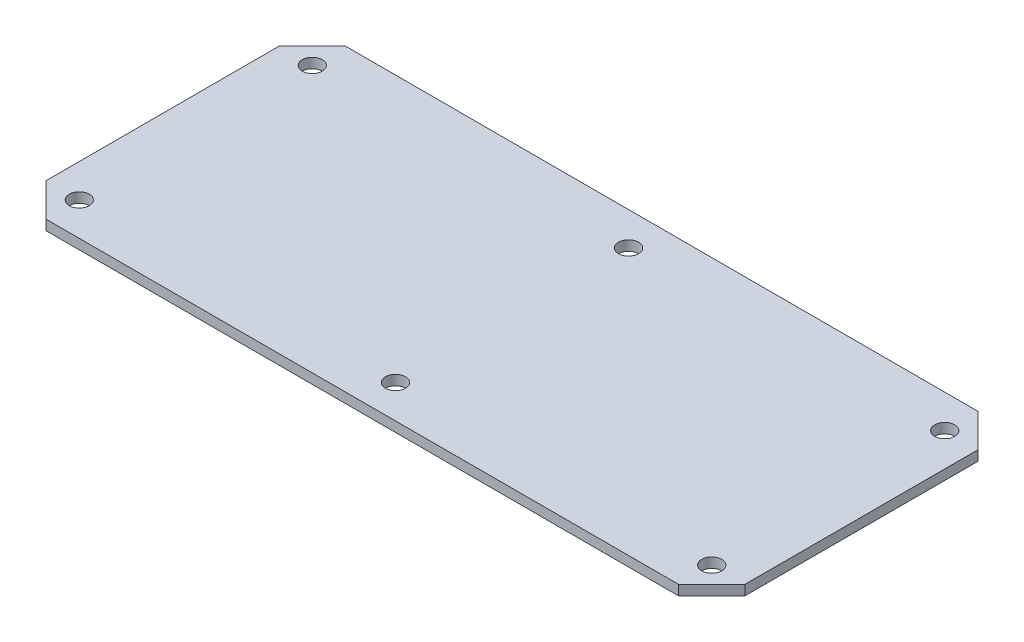
ISO-10303-21;
HEADER;
FILE_DESCRIPTION(('STEP AP214'),'2;1');
FILE_NAME('part.step','',(''),(''),'','','');
FILE_SCHEMA(('AUTOMOTIVE_DESIGN { 1 0 10303 214 1 1 1 1 }'));
ENDSEC;
DATA;
#1=APPLICATION_CONTEXT('core data for automotive mechanical design processes');
#2=APPLICATION_PROTOCOL_DEFINITION('international standard','automotive_design',2000,#1);
#3=PRODUCT_CONTEXT('',#1,'mechanical');
#4=PRODUCT('Part','Part','',(#3));
#5=PRODUCT_RELATED_PRODUCT_CATEGORY('part','',(#4));
#6=PRODUCT_DEFINITION_FORMATION('','',#4);
#7=PRODUCT_DEFINITION_CONTEXT('part definition',#1,'design');
#8=PRODUCT_DEFINITION('design','',#6,#7);
#9=PRODUCT_DEFINITION_SHAPE('','',#8);
#10=(LENGTH_UNIT() NAMED_UNIT(*) SI_UNIT(.MILLI.,.METRE.));
#11=(NAMED_UNIT(*) PLANE_ANGLE_UNIT() SI_UNIT($,.RADIAN.));
#12=(NAMED_UNIT(*) SI_UNIT($,.STERADIAN.) SOLID_ANGLE_UNIT());
#13=UNCERTAINTY_MEASURE_WITH_UNIT(LENGTH_MEASURE(1.E-05),#10,'distance_accuracy_value','');
#14=(GEOMETRIC_REPRESENTATION_CONTEXT(3) GLOBAL_UNCERTAINTY_ASSIGNED_CONTEXT((#13)) GLOBAL_UNIT_ASSIGNED_CONTEXT((#10,
#11,#12)) REPRESENTATION_CONTEXT('',''));
#15=CARTESIAN_POINT('',(0.,0.,0.));
#16=DIRECTION('',(0.,0.,1.));
#17=DIRECTION('',(1.,0.,0.));
#18=AXIS2_PLACEMENT_3D('',#15,#16,#17);
#19=CARTESIAN_POINT('',(210.,3.,-90.));
#20=DIRECTION('',(-1.,0.,0.));
#21=DIRECTION('',(0.,0.,1.));
#22=AXIS2_PLACEMENT_3D('',#19,#20,#21);
#23=PLANE('',#22);
#24=DIRECTION('',(0.,0.,-1.));
#25=VECTOR('',#24,1.);
#26=CARTESIAN_POINT('',(210.,3.,-90.));
#27=LINE('',#26,#25);
#28=CARTESIAN_POINT('',(210.,3.,-10.0000000000001));
#29=VERTEX_POINT('',#28);
#30=CARTESIAN_POINT('',(210.,3.,-79.9999999999999));
#31=VERTEX_POINT('',#30);
#32=EDGE_CURVE('E116',#29,#31,#27,.T.);
#33=ORIENTED_EDGE('',*,*,#32,.F.);
#34=DIRECTION('',(0.,-1.,0.));
#35=VECTOR('',#34,1.);
#36=CARTESIAN_POINT('',(210.,3.,-10.));
#37=LINE('',#36,#35);
#38=CARTESIAN_POINT('',(210.,0.,-10.0000000000001));
#39=VERTEX_POINT('',#38);
#40=EDGE_CURVE('E101',#29,#39,#37,.T.);
#41=ORIENTED_EDGE('',*,*,#40,.T.);
#42=DIRECTION('',(0.,0.,-1.));
#43=VECTOR('',#42,1.);
#44=CARTESIAN_POINT('',(210.,0.,-90.));
#45=LINE('',#44,#43);
#46=CARTESIAN_POINT('',(210.,0.,-79.9999999999999));
#47=VERTEX_POINT('',#46);
#48=EDGE_CURVE('E113',#39,#47,#45,.T.);
#49=ORIENTED_EDGE('',*,*,#48,.T.);
#50=DIRECTION('',(0.,1.,0.));
#51=VECTOR('',#50,1.);
#52=CARTESIAN_POINT('',(210.,3.,-79.9999999999999));
#53=LINE('',#52,#51);
#54=EDGE_CURVE('E118',#47,#31,#53,.T.);
#55=ORIENTED_EDGE('',*,*,#54,.T.);
#56=EDGE_LOOP('',(#33,#41,#49,#55));
#57=FACE_BOUND('',#56,.T.);
#58=ADVANCED_FACE('F32',(#57),#23,.F.);
#59=CARTESIAN_POINT('',(210.,3.,-90.));
#60=DIRECTION('',(0.,0.,1.));
#61=DIRECTION('',(1.,0.,0.));
#62=AXIS2_PLACEMENT_3D('',#59,#60,#61);
#63=PLANE('',#62);
#64=DIRECTION('',(-1.,0.,0.));
#65=VECTOR('',#64,1.);
#66=CARTESIAN_POINT('',(210.,3.,-90.));
#67=LINE('',#66,#65);
#68=CARTESIAN_POINT('',(200.,3.,-90.));
#69=VERTEX_POINT('',#68);
#70=CARTESIAN_POINT('',(10.0000000000001,3.,-90.));
#71=VERTEX_POINT('',#70);
#72=EDGE_CURVE('E171',#69,#71,#67,.T.);
#73=ORIENTED_EDGE('',*,*,#72,.F.);
#74=DIRECTION('',(0.,-1.,0.));
#75=VECTOR('',#74,1.);
#76=CARTESIAN_POINT('',(200.,3.,-90.));
#77=LINE('',#76,#75);
#78=CARTESIAN_POINT('',(200.,0.,-90.));
#79=VERTEX_POINT('',#78);
#80=EDGE_CURVE('E155',#69,#79,#77,.T.);
#81=ORIENTED_EDGE('',*,*,#80,.T.);
#82=DIRECTION('',(-1.,0.,0.));
#83=VECTOR('',#82,1.);
#84=CARTESIAN_POINT('',(210.,0.,-90.));
#85=LINE('',#84,#83);
#86=CARTESIAN_POINT('',(10.0000000000001,0.,-90.));
#87=VERTEX_POINT('',#86);
#88=EDGE_CURVE('E122',#79,#87,#85,.T.);
#89=ORIENTED_EDGE('',*,*,#88,.T.);
#90=DIRECTION('',(0.,1.,0.));
#91=VECTOR('',#90,1.);
#92=CARTESIAN_POINT('',(10.0000000000001,3.,-90.));
#93=LINE('',#92,#91);
#94=EDGE_CURVE('E153',#87,#71,#93,.T.);
#95=ORIENTED_EDGE('',*,*,#94,.T.);
#96=EDGE_LOOP('',(#73,#81,#89,#95));
#97=FACE_BOUND('',#96,.T.);
#98=ADVANCED_FACE('F236',(#97),#63,.F.);
#99=CARTESIAN_POINT('',(0.,3.,-90.));
#100=DIRECTION('',(1.,0.,0.));
#101=DIRECTION('',(0.,0.,-1.));
#102=AXIS2_PLACEMENT_3D('',#99,#100,#101);
#103=PLANE('',#102);
#104=DIRECTION('',(0.,0.,1.));
#105=VECTOR('',#104,1.);
#106=CARTESIAN_POINT('',(0.,0.,-90.));
#107=LINE('',#106,#105);
#108=CARTESIAN_POINT('',(0.,0.,-80.));
#109=VERTEX_POINT('',#108);
#110=CARTESIAN_POINT('',(0.,0.,-10.0000000000001));
#111=VERTEX_POINT('',#110);
#112=EDGE_CURVE('E126',#109,#111,#107,.T.);
#113=ORIENTED_EDGE('',*,*,#112,.T.);
#114=DIRECTION('',(0.,1.,0.));
#115=VECTOR('',#114,1.);
#116=CARTESIAN_POINT('',(0.,3.,-10.0000000000001));
#117=LINE('',#116,#115);
#118=CARTESIAN_POINT('',(0.,3.,-10.0000000000001));
#119=VERTEX_POINT('',#118);
#120=EDGE_CURVE('E11',#111,#119,#117,.T.);
#121=ORIENTED_EDGE('',*,*,#120,.T.);
#122=DIRECTION('',(0.,0.,1.));
#123=VECTOR('',#122,1.);
#124=CARTESIAN_POINT('',(0.,3.,-90.));
#125=LINE('',#124,#123);
#126=CARTESIAN_POINT('',(0.,3.,-80.));
#127=VERTEX_POINT('',#126);
#128=EDGE_CURVE('E161',#127,#119,#125,.T.);
#129=ORIENTED_EDGE('',*,*,#128,.F.);
#130=DIRECTION('',(0.,-1.,0.));
#131=VECTOR('',#130,1.);
#132=CARTESIAN_POINT('',(0.,3.,-80.));
#133=LINE('',#132,#131);
#134=EDGE_CURVE('E40',#127,#109,#133,.T.);
#135=ORIENTED_EDGE('',*,*,#134,.T.);
#136=EDGE_LOOP('',(#113,#121,#129,#135));
#137=FACE_BOUND('',#136,.T.);
#138=ADVANCED_FACE('F160',(#137),#103,.F.);
#139=CARTESIAN_POINT('',(210.,3.,0.));
#140=DIRECTION('',(0.,0.,-1.));
#141=DIRECTION('',(-1.,0.,0.));
#142=AXIS2_PLACEMENT_3D('',#139,#140,#141);
#143=PLANE('',#142);
#144=DIRECTION('',(1.,0.,0.));
#145=VECTOR('',#144,1.);
#146=CARTESIAN_POINT('',(210.,0.,0.));
#147=LINE('',#146,#145);
#148=CARTESIAN_POINT('',(10.,0.,0.));
#149=VERTEX_POINT('',#148);
#150=CARTESIAN_POINT('',(200.,0.,0.));
#151=VERTEX_POINT('',#150);
#152=EDGE_CURVE('E136',#149,#151,#147,.T.);
#153=ORIENTED_EDGE('',*,*,#152,.T.);
#154=DIRECTION('',(0.,1.,0.));
#155=VECTOR('',#154,1.);
#156=CARTESIAN_POINT('',(200.,3.,0.));
#157=LINE('',#156,#155);
#158=CARTESIAN_POINT('',(200.,3.,0.));
#159=VERTEX_POINT('',#158);
#160=EDGE_CURVE('E102',#151,#159,#157,.T.);
#161=ORIENTED_EDGE('',*,*,#160,.T.);
#162=DIRECTION('',(1.,0.,0.));
#163=VECTOR('',#162,1.);
#164=CARTESIAN_POINT('',(210.,3.,0.));
#165=LINE('',#164,#163);
#166=CARTESIAN_POINT('',(10.,3.,0.));
#167=VERTEX_POINT('',#166);
#168=EDGE_CURVE('E132',#167,#159,#165,.T.);
#169=ORIENTED_EDGE('',*,*,#168,.F.);
#170=DIRECTION('',(0.,-1.,0.));
#171=VECTOR('',#170,1.);
#172=CARTESIAN_POINT('',(10.,3.,0.));
#173=LINE('',#172,#171);
#174=EDGE_CURVE('E107',#167,#149,#173,.T.);
#175=ORIENTED_EDGE('',*,*,#174,.T.);
#176=EDGE_LOOP('',(#153,#161,#169,#175));
#177=FACE_BOUND('',#176,.T.);
#178=ADVANCED_FACE('F169',(#177),#143,.F.);
#179=CARTESIAN_POINT('',(0.,3.,0.));
#180=DIRECTION('',(0.,-1.,0.));
#181=DIRECTION('',(0.,0.,-1.));
#182=AXIS2_PLACEMENT_3D('',#179,#180,#181);
#183=PLANE('',#182);
#184=CARTESIAN_POINT('',(10.,3.,-10.));
#185=DIRECTION('',(0.,1.,0.));
#186=DIRECTION('',(0.,0.,1.));
#187=AXIS2_PLACEMENT_3D('',#184,#185,#186);
#188=CIRCLE('',#187,3.);
#189=CARTESIAN_POINT('',(10.,3.,-7.00000000000002));
#190=VERTEX_POINT('',#189);
#191=EDGE_CURVE('E178',#190,#190,#188,.T.);
#192=ORIENTED_EDGE('',*,*,#191,.F.);
#193=EDGE_LOOP('',(#192));
#194=FACE_BOUND('',#193,.T.);
#195=CARTESIAN_POINT('',(105.,3.,-10.));
#196=DIRECTION('',(0.,1.,0.));
#197=DIRECTION('',(0.,0.,1.));
#198=AXIS2_PLACEMENT_3D('',#195,#196,#197);
#199=CIRCLE('',#198,3.00000000000001);
#200=CARTESIAN_POINT('',(105.,3.,-7.00000000000002));
#201=VERTEX_POINT('',#200);
#202=EDGE_CURVE('E184',#201,#201,#199,.T.);
#203=ORIENTED_EDGE('',*,*,#202,.F.);
#204=EDGE_LOOP('',(#203));
#205=FACE_BOUND('',#204,.T.);
#206=CARTESIAN_POINT('',(200.,3.,-10.));
#207=DIRECTION('',(0.,1.,0.));
#208=DIRECTION('',(0.,0.,1.));
#209=AXIS2_PLACEMENT_3D('',#206,#207,#208);
#210=CIRCLE('',#209,2.99999999999999);
#211=CARTESIAN_POINT('',(200.,3.,-7.00000000000004));
#212=VERTEX_POINT('',#211);
#213=EDGE_CURVE('E190',#212,#212,#210,.T.);
#214=ORIENTED_EDGE('',*,*,#213,.F.);
#215=EDGE_LOOP('',(#214));
#216=FACE_BOUND('',#215,.T.);
#217=CARTESIAN_POINT('',(200.,3.,-80.));
#218=DIRECTION('',(0.,1.,0.));
#219=DIRECTION('',(0.,0.,1.));
#220=AXIS2_PLACEMENT_3D('',#217,#218,#219);
#221=CIRCLE('',#220,2.99999999999999);
#222=CARTESIAN_POINT('',(200.,3.,-77.));
#223=VERTEX_POINT('',#222);
#224=EDGE_CURVE('E196',#223,#223,#221,.T.);
#225=ORIENTED_EDGE('',*,*,#224,.F.);
#226=EDGE_LOOP('',(#225));
#227=FACE_BOUND('',#226,.T.);
#228=CARTESIAN_POINT('',(105.,3.,-80.));
#229=DIRECTION('',(0.,1.,0.));
#230=DIRECTION('',(0.,0.,1.));
#231=AXIS2_PLACEMENT_3D('',#228,#229,#230);
#232=CIRCLE('',#231,3.00000000000001);
#233=CARTESIAN_POINT('',(105.,3.,-77.));
#234=VERTEX_POINT('',#233);
#235=EDGE_CURVE('E202',#234,#234,#232,.T.);
#236=ORIENTED_EDGE('',*,*,#235,.F.);
#237=EDGE_LOOP('',(#236));
#238=FACE_BOUND('',#237,.T.);
#239=CARTESIAN_POINT('',(10.,3.,-80.));
#240=DIRECTION('',(0.,1.,0.));
#241=DIRECTION('',(0.,0.,1.));
#242=AXIS2_PLACEMENT_3D('',#239,#240,#241);
#243=CIRCLE('',#242,3.);
#244=CARTESIAN_POINT('',(10.,3.,-77.));
#245=VERTEX_POINT('',#244);
#246=EDGE_CURVE('E129',#245,#245,#243,.T.);
#247=ORIENTED_EDGE('',*,*,#246,.F.);
#248=EDGE_LOOP('',(#247));
#249=FACE_BOUND('',#248,.T.);
#250=ORIENTED_EDGE('',*,*,#168,.T.);
#251=DIRECTION('',(-0.707106781186549,0.,0.707106781186547));
#252=VECTOR('',#251,1.);
#253=CARTESIAN_POINT('',(210.,3.,-10.));
#254=LINE('',#253,#252);
#255=EDGE_CURVE('E151',#159,#29,#254,.F.);
#256=ORIENTED_EDGE('',*,*,#255,.T.);
#257=ORIENTED_EDGE('',*,*,#32,.T.);
#258=DIRECTION('',(0.707106781186547,0.,0.707106781186549));
#259=VECTOR('',#258,1.);
#260=CARTESIAN_POINT('',(200.,3.,-90.));
#261=LINE('',#260,#259);
#262=EDGE_CURVE('E149',#31,#69,#261,.F.);
#263=ORIENTED_EDGE('',*,*,#262,.T.);
#264=ORIENTED_EDGE('',*,*,#72,.T.);
#265=DIRECTION('',(0.70710678118655,0.,-0.707106781186545));
#266=VECTOR('',#265,1.);
#267=CARTESIAN_POINT('',(0.,3.,-80.));
#268=LINE('',#267,#266);
#269=EDGE_CURVE('E52',#71,#127,#268,.F.);
#270=ORIENTED_EDGE('',*,*,#269,.T.);
#271=ORIENTED_EDGE('',*,*,#128,.T.);
#272=DIRECTION('',(-0.707106781186547,0.,-0.707106781186549));
#273=VECTOR('',#272,1.);
#274=CARTESIAN_POINT('',(10.,3.,0.));
#275=LINE('',#274,#273);
#276=EDGE_CURVE('E147',#119,#167,#275,.F.);
#277=ORIENTED_EDGE('',*,*,#276,.T.);
#278=EDGE_LOOP('',(#250,#256,#257,#263,#264,#270,#271,#277));
#279=FACE_BOUND('',#278,.T.);
#280=ADVANCED_FACE('F218',(#194,#205,#216,#227,#238,#249,#279),#183,.F.);
#281=CARTESIAN_POINT('',(0.,0.,0.));
#282=DIRECTION('',(0.,-1.,0.));
#283=DIRECTION('',(0.,0.,-1.));
#284=AXIS2_PLACEMENT_3D('',#281,#282,#283);
#285=PLANE('',#284);
#286=CARTESIAN_POINT('',(10.,0.,-10.));
#287=DIRECTION('',(0.,1.,0.));
#288=DIRECTION('',(0.,0.,1.));
#289=AXIS2_PLACEMENT_3D('',#286,#287,#288);
#290=CIRCLE('',#289,3.);
#291=CARTESIAN_POINT('',(10.,0.,-7.00000000000002));
#292=VERTEX_POINT('',#291);
#293=EDGE_CURVE('E181',#292,#292,#290,.T.);
#294=ORIENTED_EDGE('',*,*,#293,.T.);
#295=EDGE_LOOP('',(#294));
#296=FACE_BOUND('',#295,.T.);
#297=CARTESIAN_POINT('',(105.,0.,-10.));
#298=DIRECTION('',(0.,1.,0.));
#299=DIRECTION('',(0.,0.,1.));
#300=AXIS2_PLACEMENT_3D('',#297,#298,#299);
#301=CIRCLE('',#300,3.00000000000001);
#302=CARTESIAN_POINT('',(105.,0.,-7.00000000000002));
#303=VERTEX_POINT('',#302);
#304=EDGE_CURVE('E187',#303,#303,#301,.T.);
#305=ORIENTED_EDGE('',*,*,#304,.T.);
#306=EDGE_LOOP('',(#305));
#307=FACE_BOUND('',#306,.T.);
#308=CARTESIAN_POINT('',(200.,0.,-10.));
#309=DIRECTION('',(0.,1.,0.));
#310=DIRECTION('',(0.,0.,1.));
#311=AXIS2_PLACEMENT_3D('',#308,#309,#310);
#312=CIRCLE('',#311,2.99999999999999);
#313=CARTESIAN_POINT('',(200.,0.,-7.00000000000004));
#314=VERTEX_POINT('',#313);
#315=EDGE_CURVE('E193',#314,#314,#312,.T.);
#316=ORIENTED_EDGE('',*,*,#315,.T.);
#317=EDGE_LOOP('',(#316));
#318=FACE_BOUND('',#317,.T.);
#319=CARTESIAN_POINT('',(200.,0.,-80.));
#320=DIRECTION('',(0.,1.,0.));
#321=DIRECTION('',(0.,0.,1.));
#322=AXIS2_PLACEMENT_3D('',#319,#320,#321);
#323=CIRCLE('',#322,2.99999999999999);
#324=CARTESIAN_POINT('',(200.,0.,-77.));
#325=VERTEX_POINT('',#324);
#326=EDGE_CURVE('E199',#325,#325,#323,.T.);
#327=ORIENTED_EDGE('',*,*,#326,.T.);
#328=EDGE_LOOP('',(#327));
#329=FACE_BOUND('',#328,.T.);
#330=CARTESIAN_POINT('',(105.,0.,-80.));
#331=DIRECTION('',(0.,1.,0.));
#332=DIRECTION('',(0.,0.,1.));
#333=AXIS2_PLACEMENT_3D('',#330,#331,#332);
#334=CIRCLE('',#333,3.00000000000001);
#335=CARTESIAN_POINT('',(105.,0.,-77.));
#336=VERTEX_POINT('',#335);
#337=EDGE_CURVE('E176',#336,#336,#334,.T.);
#338=ORIENTED_EDGE('',*,*,#337,.T.);
#339=EDGE_LOOP('',(#338));
#340=FACE_BOUND('',#339,.T.);
#341=CARTESIAN_POINT('',(10.,0.,-80.));
#342=DIRECTION('',(0.,1.,0.));
#343=DIRECTION('',(0.,0.,1.));
#344=AXIS2_PLACEMENT_3D('',#341,#342,#343);
#345=CIRCLE('',#344,3.);
#346=CARTESIAN_POINT('',(10.,0.,-77.));
#347=VERTEX_POINT('',#346);
#348=EDGE_CURVE('E123',#347,#347,#345,.T.);
#349=ORIENTED_EDGE('',*,*,#348,.T.);
#350=EDGE_LOOP('',(#349));
#351=FACE_BOUND('',#350,.T.);
#352=ORIENTED_EDGE('',*,*,#48,.F.);
#353=DIRECTION('',(0.707106781186549,0.,-0.707106781186547));
#354=VECTOR('',#353,1.);
#355=CARTESIAN_POINT('',(99.9999999999997,0.,100.));
#356=LINE('',#355,#354);
#357=EDGE_CURVE('E97',#39,#151,#356,.F.);
#358=ORIENTED_EDGE('',*,*,#357,.T.);
#359=ORIENTED_EDGE('',*,*,#152,.F.);
#360=DIRECTION('',(0.707106781186547,0.,0.707106781186549));
#361=VECTOR('',#360,1.);
#362=CARTESIAN_POINT('',(5.00000000000003,0.,-5.00000000000002));
#363=LINE('',#362,#361);
#364=EDGE_CURVE('E140',#149,#111,#363,.F.);
#365=ORIENTED_EDGE('',*,*,#364,.T.);
#366=ORIENTED_EDGE('',*,*,#112,.F.);
#367=DIRECTION('',(-0.70710678118655,0.,0.707106781186545));
#368=VECTOR('',#367,1.);
#369=CARTESIAN_POINT('',(-40.,0.,-40.0000000000002));
#370=LINE('',#369,#368);
#371=EDGE_CURVE('E117',#109,#87,#370,.F.);
#372=ORIENTED_EDGE('',*,*,#371,.T.);
#373=ORIENTED_EDGE('',*,*,#88,.F.);
#374=DIRECTION('',(-0.707106781186547,0.,-0.707106781186549));
#375=VECTOR('',#374,1.);
#376=CARTESIAN_POINT('',(145.,0.,-145.));
#377=LINE('',#376,#375);
#378=EDGE_CURVE('E108',#79,#47,#377,.F.);
#379=ORIENTED_EDGE('',*,*,#378,.T.);
#380=EDGE_LOOP('',(#352,#358,#359,#365,#366,#372,#373,#379));
#381=FACE_BOUND('',#380,.T.);
#382=ADVANCED_FACE('F120',(#296,#307,#318,#329,#340,#351,#381),#285,.T.);
#383=CARTESIAN_POINT('',(10.,0.,-80.));
#384=DIRECTION('',(0.,1.,0.));
#385=DIRECTION('',(0.,0.,1.));
#386=AXIS2_PLACEMENT_3D('',#383,#384,#385);
#387=CYLINDRICAL_SURFACE('',#386,3.);
#388=ORIENTED_EDGE('',*,*,#348,.F.);
#389=EDGE_LOOP('',(#388));
#390=FACE_BOUND('',#389,.T.);
#391=ORIENTED_EDGE('',*,*,#246,.T.);
#392=EDGE_LOOP('',(#391));
#393=FACE_BOUND('',#392,.T.);
#394=ADVANCED_FACE('F214',(#390,#393),#387,.F.);
#395=CARTESIAN_POINT('',(105.,0.,-80.));
#396=DIRECTION('',(0.,1.,0.));
#397=DIRECTION('',(0.,0.,1.));
#398=AXIS2_PLACEMENT_3D('',#395,#396,#397);
#399=CYLINDRICAL_SURFACE('',#398,3.00000000000001);
#400=ORIENTED_EDGE('',*,*,#337,.F.);
#401=EDGE_LOOP('',(#400));
#402=FACE_BOUND('',#401,.T.);
#403=ORIENTED_EDGE('',*,*,#235,.T.);
#404=EDGE_LOOP('',(#403));
#405=FACE_BOUND('',#404,.T.);
#406=ADVANCED_FACE('F210',(#402,#405),#399,.F.);
#407=CARTESIAN_POINT('',(200.,0.,-80.));
#408=DIRECTION('',(0.,1.,0.));
#409=DIRECTION('',(0.,0.,1.));
#410=AXIS2_PLACEMENT_3D('',#407,#408,#409);
#411=CYLINDRICAL_SURFACE('',#410,2.99999999999999);
#412=ORIENTED_EDGE('',*,*,#326,.F.);
#413=EDGE_LOOP('',(#412));
#414=FACE_BOUND('',#413,.T.);
#415=ORIENTED_EDGE('',*,*,#224,.T.);
#416=EDGE_LOOP('',(#415));
#417=FACE_BOUND('',#416,.T.);
#418=ADVANCED_FACE('F213',(#414,#417),#411,.F.);
#419=CARTESIAN_POINT('',(200.,0.,-10.));
#420=DIRECTION('',(0.,1.,0.));
#421=DIRECTION('',(0.,0.,1.));
#422=AXIS2_PLACEMENT_3D('',#419,#420,#421);
#423=CYLINDRICAL_SURFACE('',#422,2.99999999999999);
#424=ORIENTED_EDGE('',*,*,#315,.F.);
#425=EDGE_LOOP('',(#424));
#426=FACE_BOUND('',#425,.T.);
#427=ORIENTED_EDGE('',*,*,#213,.T.);
#428=EDGE_LOOP('',(#427));
#429=FACE_BOUND('',#428,.T.);
#430=ADVANCED_FACE('F333',(#426,#429),#423,.F.);
#431=CARTESIAN_POINT('',(105.,0.,-10.));
#432=DIRECTION('',(0.,1.,0.));
#433=DIRECTION('',(0.,0.,1.));
#434=AXIS2_PLACEMENT_3D('',#431,#432,#433);
#435=CYLINDRICAL_SURFACE('',#434,3.00000000000001);
#436=ORIENTED_EDGE('',*,*,#304,.F.);
#437=EDGE_LOOP('',(#436));
#438=FACE_BOUND('',#437,.T.);
#439=ORIENTED_EDGE('',*,*,#202,.T.);
#440=EDGE_LOOP('',(#439));
#441=FACE_BOUND('',#440,.T.);
#442=ADVANCED_FACE('F324',(#438,#441),#435,.F.);
#443=CARTESIAN_POINT('',(10.,0.,-10.));
#444=DIRECTION('',(0.,1.,0.));
#445=DIRECTION('',(0.,0.,1.));
#446=AXIS2_PLACEMENT_3D('',#443,#444,#445);
#447=CYLINDRICAL_SURFACE('',#446,3.);
#448=ORIENTED_EDGE('',*,*,#293,.F.);
#449=EDGE_LOOP('',(#448));
#450=FACE_BOUND('',#449,.T.);
#451=ORIENTED_EDGE('',*,*,#191,.T.);
#452=EDGE_LOOP('',(#451));
#453=FACE_BOUND('',#452,.T.);
#454=ADVANCED_FACE('F248',(#450,#453),#447,.F.);
#455=CARTESIAN_POINT('',(210.,3.,-10.));
#456=DIRECTION('',(-0.707106781186546,0.,-0.707106781186548));
#457=DIRECTION('',(0.,-1.,0.));
#458=AXIS2_PLACEMENT_3D('',#455,#456,#457);
#459=PLANE('',#458);
#460=ORIENTED_EDGE('',*,*,#255,.F.);
#461=ORIENTED_EDGE('',*,*,#160,.F.);
#462=ORIENTED_EDGE('',*,*,#357,.F.);
#463=ORIENTED_EDGE('',*,*,#40,.F.);
#464=EDGE_LOOP('',(#460,#461,#462,#463));
#465=FACE_BOUND('',#464,.T.);
#466=ADVANCED_FACE('F100',(#465),#459,.F.);
#467=CARTESIAN_POINT('',(200.,3.,-90.));
#468=DIRECTION('',(-0.707106781186548,0.,0.707106781186546));
#469=DIRECTION('',(0.,-1.,0.));
#470=AXIS2_PLACEMENT_3D('',#467,#468,#469);
#471=PLANE('',#470);
#472=ORIENTED_EDGE('',*,*,#262,.F.);
#473=ORIENTED_EDGE('',*,*,#54,.F.);
#474=ORIENTED_EDGE('',*,*,#378,.F.);
#475=ORIENTED_EDGE('',*,*,#80,.F.);
#476=EDGE_LOOP('',(#472,#473,#474,#475));
#477=FACE_BOUND('',#476,.T.);
#478=ADVANCED_FACE('F247',(#477),#471,.F.);
#479=CARTESIAN_POINT('',(10.,3.,0.));
#480=DIRECTION('',(0.707106781186548,0.,-0.707106781186546));
#481=DIRECTION('',(0.,-1.,0.));
#482=AXIS2_PLACEMENT_3D('',#479,#480,#481);
#483=PLANE('',#482);
#484=ORIENTED_EDGE('',*,*,#276,.F.);
#485=ORIENTED_EDGE('',*,*,#120,.F.);
#486=ORIENTED_EDGE('',*,*,#364,.F.);
#487=ORIENTED_EDGE('',*,*,#174,.F.);
#488=EDGE_LOOP('',(#484,#485,#486,#487));
#489=FACE_BOUND('',#488,.T.);
#490=ADVANCED_FACE('F166',(#489),#483,.F.);
#491=CARTESIAN_POINT('',(0.,3.,-80.));
#492=DIRECTION('',(0.707106781186545,0.,0.70710678118655));
#493=DIRECTION('',(0.,-1.,0.));
#494=AXIS2_PLACEMENT_3D('',#491,#492,#493);
#495=PLANE('',#494);
#496=ORIENTED_EDGE('',*,*,#269,.F.);
#497=ORIENTED_EDGE('',*,*,#94,.F.);
#498=ORIENTED_EDGE('',*,*,#371,.F.);
#499=ORIENTED_EDGE('',*,*,#134,.F.);
#500=EDGE_LOOP('',(#496,#497,#498,#499));
#501=FACE_BOUND('',#500,.T.);
#502=ADVANCED_FACE('F34',(#501),#495,.F.);
#503=CLOSED_SHELL('',(#58,#98,#138,#178,#280,#382,#394,#406,#418,#430,#442,#454,#466,#478,#490,#502));
#504=MANIFOLD_SOLID_BREP('B2',#503);
#505=ADVANCED_BREP_SHAPE_REPRESENTATION('',(#18,#504),#14);
#506=SHAPE_DEFINITION_REPRESENTATION(#9,#505);
ENDSEC;
END-ISO-10303-21;
